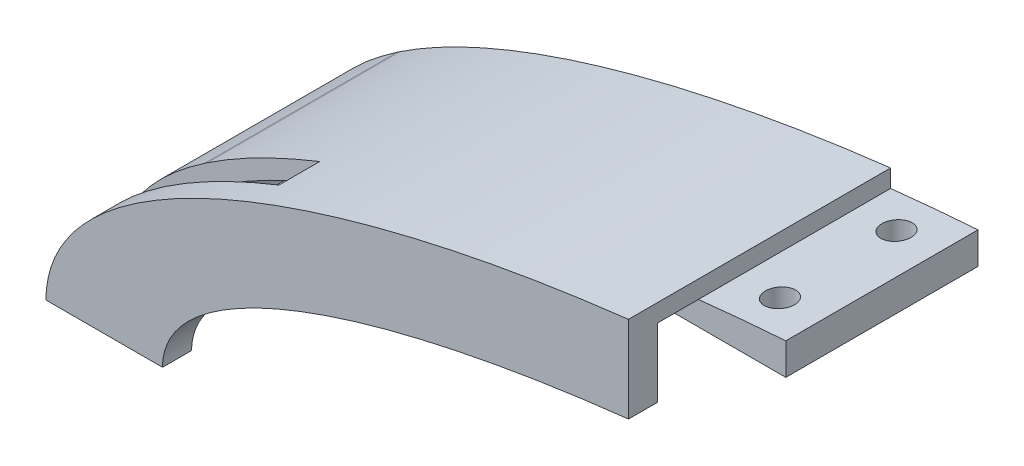
ISO-10303-21;
HEADER;
FILE_DESCRIPTION(('STEP AP214'),'2;1');
FILE_NAME('part.step','',(''),(''),'','','');
FILE_SCHEMA(('AUTOMOTIVE_DESIGN { 1 0 10303 214 1 1 1 1 }'));
ENDSEC;
DATA;
#1=APPLICATION_CONTEXT('core data for automotive mechanical design processes');
#2=APPLICATION_PROTOCOL_DEFINITION('international standard','automotive_design',2000,#1);
#3=PRODUCT_CONTEXT('',#1,'mechanical');
#4=PRODUCT('Part','Part','',(#3));
#5=PRODUCT_RELATED_PRODUCT_CATEGORY('part','',(#4));
#6=PRODUCT_DEFINITION_FORMATION('','',#4);
#7=PRODUCT_DEFINITION_CONTEXT('part definition',#1,'design');
#8=PRODUCT_DEFINITION('design','',#6,#7);
#9=PRODUCT_DEFINITION_SHAPE('','',#8);
#10=(LENGTH_UNIT() NAMED_UNIT(*) SI_UNIT(.MILLI.,.METRE.));
#11=(NAMED_UNIT(*) PLANE_ANGLE_UNIT() SI_UNIT($,.RADIAN.));
#12=(NAMED_UNIT(*) SI_UNIT($,.STERADIAN.) SOLID_ANGLE_UNIT());
#13=UNCERTAINTY_MEASURE_WITH_UNIT(LENGTH_MEASURE(1.E-05),#10,'distance_accuracy_value','');
#14=(GEOMETRIC_REPRESENTATION_CONTEXT(3) GLOBAL_UNCERTAINTY_ASSIGNED_CONTEXT((#13)) GLOBAL_UNIT_ASSIGNED_CONTEXT((#10,
#11,#12)) REPRESENTATION_CONTEXT('',''));
#15=CARTESIAN_POINT('',(0.,0.,0.));
#16=DIRECTION('',(0.,0.,1.));
#17=DIRECTION('',(1.,0.,0.));
#18=AXIS2_PLACEMENT_3D('',#15,#16,#17);
#19=CARTESIAN_POINT('',(-50.,0.,0.));
#20=DIRECTION('',(-1.,0.,0.));
#21=DIRECTION('',(0.,-1.,0.));
#22=AXIS2_PLACEMENT_3D('',#19,#20,#21);
#23=PLANE('',#22);
#24=DIRECTION('',(0.,0.,1.));
#25=VECTOR('',#24,1.);
#26=CARTESIAN_POINT('',(-50.,44.0928528927283,-40.));
#27=LINE('',#26,#25);
#28=CARTESIAN_POINT('',(-50.,44.0928528927283,0.));
#29=VERTEX_POINT('',#28);
#30=CARTESIAN_POINT('',(-50.,44.0928528927283,-7.00000000000003));
#31=VERTEX_POINT('',#30);
#32=EDGE_CURVE('E47',#29,#31,#27,.F.);
#33=ORIENTED_EDGE('',*,*,#32,.T.);
#34=DIRECTION('',(0.,0.,1.));
#35=VECTOR('',#34,1.);
#36=CARTESIAN_POINT('',(-50.,44.0928528927283,-40.));
#37=LINE('',#36,#35);
#38=CARTESIAN_POINT('',(-50.0000000000001,44.0928528927283,-40.));
#39=VERTEX_POINT('',#38);
#40=EDGE_CURVE('E210',#39,#31,#37,.T.);
#41=ORIENTED_EDGE('',*,*,#40,.F.);
#42=DIRECTION('',(0.,-1.,0.));
#43=VECTOR('',#42,1.);
#44=CARTESIAN_POINT('',(-50.,0.,-40.));
#45=LINE('',#44,#43);
#46=CARTESIAN_POINT('',(-50.,47.1404520791032,-40.));
#47=VERTEX_POINT('',#46);
#48=EDGE_CURVE('E336',#47,#39,#45,.T.);
#49=ORIENTED_EDGE('',*,*,#48,.F.);
#50=DIRECTION('',(0.,0.,-1.));
#51=VECTOR('',#50,1.);
#52=CARTESIAN_POINT('',(-50.,47.1404520791032,5.));
#53=LINE('',#52,#51);
#54=CARTESIAN_POINT('',(-50.,47.1404520791032,5.));
#55=VERTEX_POINT('',#54);
#56=EDGE_CURVE('E458',#55,#47,#53,.T.);
#57=ORIENTED_EDGE('',*,*,#56,.F.);
#58=DIRECTION('',(0.,-1.,0.));
#59=VECTOR('',#58,1.);
#60=CARTESIAN_POINT('',(-50.,0.,5.));
#61=LINE('',#60,#59);
#62=CARTESIAN_POINT('',(-50.,32.3076923076923,5.));
#63=VERTEX_POINT('',#62);
#64=EDGE_CURVE('E11',#55,#63,#61,.T.);
#65=ORIENTED_EDGE('',*,*,#64,.T.);
#66=DIRECTION('',(0.,0.,1.));
#67=VECTOR('',#66,1.);
#68=CARTESIAN_POINT('',(-50.,32.3076923076923,2.5));
#69=LINE('',#68,#67);
#70=CARTESIAN_POINT('',(-50.,32.3076923076923,0.));
#71=VERTEX_POINT('',#70);
#72=EDGE_CURVE('E338',#71,#63,#69,.T.);
#73=ORIENTED_EDGE('',*,*,#72,.F.);
#74=DIRECTION('',(0.,-1.,0.));
#75=VECTOR('',#74,1.);
#76=CARTESIAN_POINT('',(-50.,0.,0.));
#77=LINE('',#76,#75);
#78=EDGE_CURVE('E42',#29,#71,#77,.T.);
#79=ORIENTED_EDGE('',*,*,#78,.F.);
#80=EDGE_LOOP('',(#33,#41,#49,#57,#65,#73,#79));
#81=FACE_BOUND('',#80,.T.);
#82=ADVANCED_FACE('F39',(#81),#23,.F.);
#83=CARTESIAN_POINT('',(0.,0.,5.));
#84=DIRECTION('',(0.,0.,1.));
#85=DIRECTION('',(1.,0.,0.));
#86=AXIS2_PLACEMENT_3D('',#83,#84,#85);
#87=ELLIPSE('',#86,150.,50.);
#88=DIRECTION('',(0.,0.,-1.));
#89=VECTOR('',#88,1.);
#90=SURFACE_OF_LINEAR_EXTRUSION('',#87,#89);
#91=CARTESIAN_POINT('',(-134.274226106668,22.2870969233957,5.));
#92=VERTEX_POINT('',#91);
#93=EDGE_CURVE('E340',#55,#92,#87,.T.);
#94=ORIENTED_EDGE('',*,*,#93,.F.);
#95=ORIENTED_EDGE('',*,*,#56,.T.);
#96=CARTESIAN_POINT('',(0.,0.,-40.));
#97=DIRECTION('',(0.,0.,1.));
#98=DIRECTION('',(1.,0.,0.));
#99=AXIS2_PLACEMENT_3D('',#96,#97,#98);
#100=ELLIPSE('',#99,150.,50.);
#101=CARTESIAN_POINT('',(-134.274226106668,22.2870969233957,-40.));
#102=VERTEX_POINT('',#101);
#103=EDGE_CURVE('E299',#47,#102,#100,.T.);
#104=ORIENTED_EDGE('',*,*,#103,.T.);
#105=DIRECTION('',(0.,0.,1.));
#106=VECTOR('',#105,1.);
#107=CARTESIAN_POINT('',(-134.274226106668,22.2870969233957,-40.));
#108=LINE('',#107,#106);
#109=CARTESIAN_POINT('',(-134.274226106668,22.2870969233956,-7.00000000000002));
#110=VERTEX_POINT('',#109);
#111=EDGE_CURVE('E318',#102,#110,#108,.T.);
#112=ORIENTED_EDGE('',*,*,#111,.T.);
#113=CARTESIAN_POINT('',(0.,0.,-7.));
#114=DIRECTION('',(0.,0.,1.));
#115=DIRECTION('',(1.,0.,0.));
#116=AXIS2_PLACEMENT_3D('',#113,#114,#115);
#117=ELLIPSE('',#116,150.,50.);
#118=CARTESIAN_POINT('',(-115.,32.1022671404304,-7.));
#119=VERTEX_POINT('',#118);
#120=EDGE_CURVE('E433',#110,#119,#117,.F.);
#121=ORIENTED_EDGE('',*,*,#120,.T.);
#122=DIRECTION('',(0.,0.,-1.));
#123=VECTOR('',#122,1.);
#124=CARTESIAN_POINT('',(-115.,32.1022671404304,5.));
#125=LINE('',#124,#123);
#126=CARTESIAN_POINT('',(-115.,32.1022671404304,0.));
#127=VERTEX_POINT('',#126);
#128=EDGE_CURVE('E429',#127,#119,#125,.T.);
#129=ORIENTED_EDGE('',*,*,#128,.F.);
#130=CARTESIAN_POINT('',(0.,0.,0.));
#131=DIRECTION('',(0.,0.,1.));
#132=DIRECTION('',(1.,0.,0.));
#133=AXIS2_PLACEMENT_3D('',#130,#131,#132);
#134=ELLIPSE('',#133,150.,50.);
#135=CARTESIAN_POINT('',(-134.274226106668,22.2870969233956,0.));
#136=VERTEX_POINT('',#135);
#137=EDGE_CURVE('E424',#136,#127,#134,.F.);
#138=ORIENTED_EDGE('',*,*,#137,.F.);
#139=CARTESIAN_POINT('',(0.,0.,0.));
#140=DIRECTION('',(0.,0.,1.));
#141=DIRECTION('',(1.,0.,0.));
#142=AXIS2_PLACEMENT_3D('',#139,#140,#141);
#143=ELLIPSE('',#142,150.,50.);
#144=CARTESIAN_POINT('',(-134.779349014432,21.9457084623899,0.));
#145=VERTEX_POINT('',#144);
#146=EDGE_CURVE('E420',#136,#145,#143,.T.);
#147=ORIENTED_EDGE('',*,*,#146,.T.);
#148=CARTESIAN_POINT('',(0.,0.,0.));
#149=DIRECTION('',(0.,0.,1.));
#150=DIRECTION('',(1.,0.,0.));
#151=AXIS2_PLACEMENT_3D('',#148,#149,#150);
#152=ELLIPSE('',#151,150.,50.);
#153=CARTESIAN_POINT('',(-150.,0.,0.));
#154=VERTEX_POINT('',#153);
#155=EDGE_CURVE('E359',#145,#154,#152,.T.);
#156=ORIENTED_EDGE('',*,*,#155,.T.);
#157=DIRECTION('',(0.,0.,-1.));
#158=VECTOR('',#157,1.);
#159=CARTESIAN_POINT('',(-150.,0.,5.));
#160=LINE('',#159,#158);
#161=CARTESIAN_POINT('',(-150.,0.,5.));
#162=VERTEX_POINT('',#161);
#163=EDGE_CURVE('E331',#154,#162,#160,.F.);
#164=ORIENTED_EDGE('',*,*,#163,.T.);
#165=CARTESIAN_POINT('',(-134.779349014434,21.9457084623884,5.));
#166=VERTEX_POINT('',#165);
#167=EDGE_CURVE('E344',#166,#162,#87,.T.);
#168=ORIENTED_EDGE('',*,*,#167,.F.);
#169=CARTESIAN_POINT('',(0.,0.,5.));
#170=DIRECTION('',(0.,0.,-1.));
#171=DIRECTION('',(1.,0.,0.));
#172=AXIS2_PLACEMENT_3D('',#169,#170,#171);
#173=ELLIPSE('',#172,150.,50.);
#174=EDGE_CURVE('E368',#92,#166,#173,.F.);
#175=ORIENTED_EDGE('',*,*,#174,.F.);
#176=EDGE_LOOP('',(#94,#95,#104,#112,#121,#129,#138,#147,#156,#164,#168,#175));
#177=FACE_BOUND('',#176,.T.);
#178=ADVANCED_FACE('F250',(#177),#90,.F.);
#179=DIRECTION('',(0.,0.,1.));
#180=VECTOR('',#179,1.);
#181=CARTESIAN_POINT('',(-145.300907362266,12.4170416932275,-40.));
#182=LINE('',#181,#180);
#183=CARTESIAN_POINT('',(-145.300907362266,12.4170416932275,-40.));
#184=VERTEX_POINT('',#183);
#185=CARTESIAN_POINT('',(-145.300907362266,12.4170416932275,-7.00000000000002));
#186=VERTEX_POINT('',#185);
#187=EDGE_CURVE('E306',#184,#186,#182,.T.);
#188=ORIENTED_EDGE('',*,*,#187,.T.);
#189=CARTESIAN_POINT('',(-134.779349014432,21.9457084623899,-7.));
#190=VERTEX_POINT('',#189);
#191=EDGE_CURVE('E405',#186,#190,#117,.F.);
#192=ORIENTED_EDGE('',*,*,#191,.T.);
#193=DIRECTION('',(0.,0.,1.));
#194=VECTOR('',#193,1.);
#195=CARTESIAN_POINT('',(-134.779349014432,21.9457084623899,-40.));
#196=LINE('',#195,#194);
#197=CARTESIAN_POINT('',(-134.779349014432,21.9457084623899,-40.));
#198=VERTEX_POINT('',#197);
#199=EDGE_CURVE('E315',#198,#190,#196,.T.);
#200=ORIENTED_EDGE('',*,*,#199,.F.);
#201=EDGE_CURVE('E292',#198,#184,#100,.T.);
#202=ORIENTED_EDGE('',*,*,#201,.T.);
#203=EDGE_LOOP('',(#188,#192,#200,#202));
#204=FACE_BOUND('',#203,.T.);
#205=ADVANCED_FACE('F257',(#204),#90,.F.);
#206=CARTESIAN_POINT('',(-172.714644282662,0.,-343.285055293836));
#207=DIRECTION('',(0.,1.,0.));
#208=DIRECTION('',(0.,0.,1.));
#209=AXIS2_PLACEMENT_3D('',#206,#207,#208);
#210=PLANE('',#209);
#211=ORIENTED_EDGE('',*,*,#163,.F.);
#212=DIRECTION('',(1.,0.,0.));
#213=VECTOR('',#212,1.);
#214=CARTESIAN_POINT('',(-172.714644282662,0.,0.));
#215=LINE('',#214,#213);
#216=CARTESIAN_POINT('',(-130.,0.,0.));
#217=VERTEX_POINT('',#216);
#218=EDGE_CURVE('E328',#154,#217,#215,.T.);
#219=ORIENTED_EDGE('',*,*,#218,.T.);
#220=DIRECTION('',(0.,0.,1.));
#221=VECTOR('',#220,1.);
#222=CARTESIAN_POINT('',(-130.,0.,2.5));
#223=LINE('',#222,#221);
#224=CARTESIAN_POINT('',(-130.,0.,5.));
#225=VERTEX_POINT('',#224);
#226=EDGE_CURVE('E343',#225,#217,#223,.F.);
#227=ORIENTED_EDGE('',*,*,#226,.F.);
#228=DIRECTION('',(-1.,0.,0.));
#229=VECTOR('',#228,1.);
#230=CARTESIAN_POINT('',(-172.714644282662,0.,5.));
#231=LINE('',#230,#229);
#232=EDGE_CURVE('E325',#225,#162,#231,.T.);
#233=ORIENTED_EDGE('',*,*,#232,.T.);
#234=EDGE_LOOP('',(#211,#219,#227,#233));
#235=FACE_BOUND('',#234,.T.);
#236=ADVANCED_FACE('F481',(#235),#210,.F.);
#237=CARTESIAN_POINT('',(-147.297229877736,0.,-40.));
#238=CARTESIAN_POINT('',(-146.55190637035,8.1210873517637,-40.));
#239=CARTESIAN_POINT('',(-134.103124610867,20.5937570390856,-40.));
#240=CARTESIAN_POINT('',(-110.28433455085,31.4682746566878,-40.));
#241=CARTESIAN_POINT('',(-65.5548375328861,44.1559680318761,-40.));
#242=CARTESIAN_POINT('',(-27.8686299807415,46.563681344994,-40.));
#243=CARTESIAN_POINT('',(0.,46.6002426808814,-40.));
#244=B_SPLINE_CURVE_WITH_KNOTS('',3,(#237,#238,#239,#240,#241,#242,#243),.UNSPECIFIED.,.F.,.F.,
(4,1,1,1,4),(0.,0.141743179969019,0.308701525327165,0.483121699978807,1.),.UNSPECIFIED.);
#245=DIRECTION('',(0.,0.,1.));
#246=VECTOR('',#245,1.);
#247=SURFACE_OF_LINEAR_EXTRUSION('',#244,#246);
#248=DIRECTION('',(0.,0.,1.));
#249=VECTOR('',#248,1.);
#250=CARTESIAN_POINT('',(-65.,42.0902168247646,-40.));
#251=LINE('',#250,#249);
#252=CARTESIAN_POINT('',(-65.,42.0902168247646,-40.));
#253=VERTEX_POINT('',#252);
#254=CARTESIAN_POINT('',(-65.,42.0902168247645,-7.00000000000002));
#255=VERTEX_POINT('',#254);
#256=EDGE_CURVE('E55',#253,#255,#251,.T.);
#257=ORIENTED_EDGE('',*,*,#256,.T.);
#258=CARTESIAN_POINT('',(-147.297229877736,0.,-7.00000000000002));
#259=CARTESIAN_POINT('',(-146.55190637035,8.1210873517637,-7.00000000000002));
#260=CARTESIAN_POINT('',(-134.103124610867,20.5937570390856,-7.00000000000002));
#261=CARTESIAN_POINT('',(-110.28433455085,31.4682746566878,-7.00000000000002));
#262=CARTESIAN_POINT('',(-65.5548375328861,44.1559680318761,-7.00000000000002));
#263=CARTESIAN_POINT('',(-27.8686299807415,46.563681344994,-7.00000000000002));
#264=CARTESIAN_POINT('',(0.,46.6002426808814,-7.00000000000002));
#265=B_SPLINE_CURVE_WITH_KNOTS('',3,(#258,#259,#260,#261,#262,#263,#264),.UNSPECIFIED.,.F.,.F.,
(4,1,1,1,4),(0.,0.141743179969019,0.308701525327165,0.483121699978807,1.),.UNSPECIFIED.);
#266=EDGE_CURVE('E60',#255,#31,#265,.T.);
#267=ORIENTED_EDGE('',*,*,#266,.T.);
#268=ORIENTED_EDGE('',*,*,#32,.F.);
#269=CARTESIAN_POINT('',(-147.297229877736,0.,0.));
#270=CARTESIAN_POINT('',(-146.55190637035,8.1210873517637,0.));
#271=CARTESIAN_POINT('',(-134.103124610867,20.5937570390856,0.));
#272=CARTESIAN_POINT('',(-110.28433455085,31.4682746566878,0.));
#273=CARTESIAN_POINT('',(-65.5548375328861,44.1559680318761,0.));
#274=CARTESIAN_POINT('',(-27.8686299807415,46.563681344994,0.));
#275=CARTESIAN_POINT('',(0.,46.6002426808814,0.));
#276=B_SPLINE_CURVE_WITH_KNOTS('',3,(#269,#270,#271,#272,#273,#274,#275),.UNSPECIFIED.,.F.,.F.,
(4,1,1,1,4),(0.,0.141743179969019,0.308701525327165,0.483121699978807,1.),.UNSPECIFIED.);
#277=CARTESIAN_POINT('',(-115.,28.8998222705045,0.));
#278=VERTEX_POINT('',#277);
#279=EDGE_CURVE('E313',#278,#29,#276,.T.);
#280=ORIENTED_EDGE('',*,*,#279,.F.);
#281=DIRECTION('',(0.,0.,1.));
#282=VECTOR('',#281,1.);
#283=CARTESIAN_POINT('',(-115.,28.8998222705045,-40.));
#284=LINE('',#283,#282);
#285=CARTESIAN_POINT('',(-115.,28.8998222694203,-7.));
#286=VERTEX_POINT('',#285);
#287=EDGE_CURVE('E339',#278,#286,#284,.F.);
#288=ORIENTED_EDGE('',*,*,#287,.T.);
#289=CARTESIAN_POINT('',(-147.297229877736,0.,-7.00000000000002));
#290=CARTESIAN_POINT('',(-146.55190637035,8.1210873517637,-7.00000000000002));
#291=CARTESIAN_POINT('',(-134.103124610867,20.5937570390856,-7.00000000000002));
#292=CARTESIAN_POINT('',(-110.28433455085,31.4682746566878,-7.00000000000002));
#293=CARTESIAN_POINT('',(-65.5548375328861,44.1559680318761,-7.00000000000002));
#294=CARTESIAN_POINT('',(-27.8686299807415,46.563681344994,-7.00000000000002));
#295=CARTESIAN_POINT('',(0.,46.6002426808814,-7.00000000000002));
#296=B_SPLINE_CURVE_WITH_KNOTS('',3,(#289,#290,#291,#292,#293,#294,#295),.UNSPECIFIED.,.F.,.F.,
(4,1,1,1,4),(0.,0.141743179969019,0.308701525327165,0.483121699978807,1.),.UNSPECIFIED.);
#297=CARTESIAN_POINT('',(-147.297229877736,0.,-7.00000000000003));
#298=VERTEX_POINT('',#297);
#299=EDGE_CURVE('E393',#298,#286,#296,.T.);
#300=ORIENTED_EDGE('',*,*,#299,.F.);
#301=DIRECTION('',(0.,0.,1.));
#302=VECTOR('',#301,1.);
#303=CARTESIAN_POINT('',(-147.297229877736,0.,-40.));
#304=LINE('',#303,#302);
#305=CARTESIAN_POINT('',(-147.297229877736,0.,-40.));
#306=VERTEX_POINT('',#305);
#307=EDGE_CURVE('E291',#306,#298,#304,.T.);
#308=ORIENTED_EDGE('',*,*,#307,.F.);
#309=EDGE_CURVE('E294',#306,#253,#244,.T.);
#310=ORIENTED_EDGE('',*,*,#309,.T.);
#311=EDGE_LOOP('',(#257,#267,#268,#280,#288,#300,#308,#310));
#312=FACE_BOUND('',#311,.T.);
#313=ADVANCED_FACE('F283',(#312),#247,.T.);
#314=CARTESIAN_POINT('',(0.,0.,0.));
#315=DIRECTION('',(0.,0.,1.));
#316=DIRECTION('',(1.,0.,0.));
#317=AXIS2_PLACEMENT_3D('',#314,#315,#316);
#318=PLANE('',#317);
#319=ORIENTED_EDGE('',*,*,#279,.T.);
#320=ORIENTED_EDGE('',*,*,#78,.T.);
#321=CARTESIAN_POINT('',(0.,0.,0.));
#322=DIRECTION('',(0.,0.,1.));
#323=DIRECTION('',(1.,0.,0.));
#324=AXIS2_PLACEMENT_3D('',#321,#322,#323);
#325=ELLIPSE('',#324,130.,35.);
#326=EDGE_CURVE('E349',#217,#71,#325,.F.);
#327=ORIENTED_EDGE('',*,*,#326,.F.);
#328=ORIENTED_EDGE('',*,*,#218,.F.);
#329=ORIENTED_EDGE('',*,*,#155,.F.);
#330=ORIENTED_EDGE('',*,*,#146,.F.);
#331=ORIENTED_EDGE('',*,*,#137,.T.);
#332=DIRECTION('',(0.,-1.,0.));
#333=VECTOR('',#332,1.);
#334=CARTESIAN_POINT('',(-115.,50.0005,0.));
#335=LINE('',#334,#333);
#336=EDGE_CURVE('E406',#127,#278,#335,.T.);
#337=ORIENTED_EDGE('',*,*,#336,.T.);
#338=EDGE_LOOP('',(#319,#320,#327,#328,#329,#330,#331,#337));
#339=FACE_BOUND('',#338,.T.);
#340=ADVANCED_FACE('F422',(#339),#318,.F.);
#341=CARTESIAN_POINT('',(0.,0.,-269.258240356725));
#342=DIRECTION('',(0.,0.,1.));
#343=DIRECTION('',(1.,0.,0.));
#344=AXIS2_PLACEMENT_3D('',#341,#342,#343);
#345=ELLIPSE('',#344,130.,35.);
#346=DIRECTION('',(0.,0.,1.));
#347=VECTOR('',#346,1.);
#348=SURFACE_OF_LINEAR_EXTRUSION('',#345,#347);
#349=ORIENTED_EDGE('',*,*,#326,.T.);
#350=ORIENTED_EDGE('',*,*,#72,.T.);
#351=CARTESIAN_POINT('',(0.,0.,5.));
#352=DIRECTION('',(0.,0.,1.));
#353=DIRECTION('',(1.,0.,0.));
#354=AXIS2_PLACEMENT_3D('',#351,#352,#353);
#355=ELLIPSE('',#354,130.,35.);
#356=EDGE_CURVE('E381',#63,#225,#355,.T.);
#357=ORIENTED_EDGE('',*,*,#356,.T.);
#358=ORIENTED_EDGE('',*,*,#226,.T.);
#359=EDGE_LOOP('',(#349,#350,#357,#358));
#360=FACE_BOUND('',#359,.T.);
#361=ADVANCED_FACE('F471',(#360),#348,.F.);
#362=CARTESIAN_POINT('',(0.,0.,5.));
#363=DIRECTION('',(0.,0.,1.));
#364=DIRECTION('',(1.,0.,0.));
#365=AXIS2_PLACEMENT_3D('',#362,#363,#364);
#366=PLANE('',#365);
#367=ORIENTED_EDGE('',*,*,#64,.F.);
#368=ORIENTED_EDGE('',*,*,#93,.T.);
#369=ORIENTED_EDGE('',*,*,#174,.T.);
#370=ORIENTED_EDGE('',*,*,#167,.T.);
#371=ORIENTED_EDGE('',*,*,#232,.F.);
#372=ORIENTED_EDGE('',*,*,#356,.F.);
#373=EDGE_LOOP('',(#367,#368,#369,#370,#371,#372));
#374=FACE_BOUND('',#373,.T.);
#375=ADVANCED_FACE('F462',(#374),#366,.T.);
#376=ORIENTED_EDGE('',*,*,#307,.T.);
#377=DIRECTION('',(1.,0.,0.));
#378=VECTOR('',#377,1.);
#379=CARTESIAN_POINT('',(-150.,0.,-7.));
#380=LINE('',#379,#378);
#381=CARTESIAN_POINT('',(-150.,0.,-7.));
#382=VERTEX_POINT('',#381);
#383=EDGE_CURVE('E411',#382,#298,#380,.T.);
#384=ORIENTED_EDGE('',*,*,#383,.F.);
#385=DIRECTION('',(0.,0.,1.));
#386=VECTOR('',#385,1.);
#387=CARTESIAN_POINT('',(-150.,0.,-40.));
#388=LINE('',#387,#386);
#389=CARTESIAN_POINT('',(-150.,0.,-40.));
#390=VERTEX_POINT('',#389);
#391=EDGE_CURVE('E309',#390,#382,#388,.T.);
#392=ORIENTED_EDGE('',*,*,#391,.F.);
#393=DIRECTION('',(1.,0.,0.));
#394=VECTOR('',#393,1.);
#395=CARTESIAN_POINT('',(0.,0.,-40.));
#396=LINE('',#395,#394);
#397=EDGE_CURVE('E430',#390,#306,#396,.T.);
#398=ORIENTED_EDGE('',*,*,#397,.T.);
#399=EDGE_LOOP('',(#376,#384,#392,#398));
#400=FACE_BOUND('',#399,.T.);
#401=ADVANCED_FACE('F281',(#400),#210,.F.);
#402=CARTESIAN_POINT('',(-150.,0.,-40.));
#403=CARTESIAN_POINT('',(-149.366974801961,10.0364415380543,-40.));
#404=CARTESIAN_POINT('',(-134.490815562498,24.4032961206006,-40.));
#405=CARTESIAN_POINT('',(-108.511776452667,35.2074679810045,-40.));
#406=CARTESIAN_POINT('',(-63.6543444537667,47.1037533474138,-40.));
#407=CARTESIAN_POINT('',(-27.5396604460598,49.9400050182537,-40.));
#408=CARTESIAN_POINT('',(-5.28874849839181E-13,50.,-40.));
#409=B_SPLINE_CURVE_WITH_KNOTS('',3,(#402,#403,#404,#405,#406,#407,#408),.UNSPECIFIED.,.F.,.F.,
(4,1,1,1,4),(0.,0.164934741661339,0.354369831819262,0.50328897730762,1.),.UNSPECIFIED.);
#410=DIRECTION('',(0.,0.,1.));
#411=VECTOR('',#410,1.);
#412=SURFACE_OF_LINEAR_EXTRUSION('',#409,#411);
#413=ORIENTED_EDGE('',*,*,#199,.T.);
#414=CARTESIAN_POINT('',(-150.,0.,-7.00000000000002));
#415=CARTESIAN_POINT('',(-149.366974801961,10.0364415380543,-7.00000000000002));
#416=CARTESIAN_POINT('',(-134.490815562498,24.4032961206006,-7.00000000000002));
#417=CARTESIAN_POINT('',(-108.511776452667,35.2074679810045,-7.00000000000002));
#418=CARTESIAN_POINT('',(-63.6543444537667,47.1037533474138,-7.00000000000002));
#419=CARTESIAN_POINT('',(-27.5396604460598,49.9400050182537,-7.00000000000002));
#420=CARTESIAN_POINT('',(-5.28874849839181E-13,50.,-7.00000000000002));
#421=B_SPLINE_CURVE_WITH_KNOTS('',3,(#414,#415,#416,#417,#418,#419,#420),.UNSPECIFIED.,.F.,.F.,
(4,1,1,1,4),(0.,0.164934741661339,0.354369831819262,0.50328897730762,1.),.UNSPECIFIED.);
#422=EDGE_CURVE('E438',#190,#110,#421,.T.);
#423=ORIENTED_EDGE('',*,*,#422,.T.);
#424=ORIENTED_EDGE('',*,*,#111,.F.);
#425=EDGE_CURVE('E293',#198,#102,#409,.T.);
#426=ORIENTED_EDGE('',*,*,#425,.F.);
#427=EDGE_LOOP('',(#413,#423,#424,#426));
#428=FACE_BOUND('',#427,.T.);
#429=ADVANCED_FACE('F277',(#428),#412,.F.);
#430=ORIENTED_EDGE('',*,*,#391,.T.);
#431=CARTESIAN_POINT('',(-150.,0.,-7.00000000000002));
#432=CARTESIAN_POINT('',(-149.366974801961,10.0364415380543,-7.00000000000002));
#433=CARTESIAN_POINT('',(-134.490815562498,24.4032961206006,-7.00000000000002));
#434=CARTESIAN_POINT('',(-108.511776452667,35.2074679810045,-7.00000000000002));
#435=CARTESIAN_POINT('',(-63.6543444537667,47.1037533474138,-7.00000000000002));
#436=CARTESIAN_POINT('',(-27.5396604460598,49.9400050182537,-7.00000000000002));
#437=CARTESIAN_POINT('',(-5.28874849839181E-13,50.,-7.00000000000002));
#438=B_SPLINE_CURVE_WITH_KNOTS('',3,(#431,#432,#433,#434,#435,#436,#437),.UNSPECIFIED.,.F.,.F.,
(4,1,1,1,4),(0.,0.164934741661339,0.354369831819262,0.50328897730762,1.),.UNSPECIFIED.);
#439=EDGE_CURVE('E402',#382,#186,#438,.T.);
#440=ORIENTED_EDGE('',*,*,#439,.T.);
#441=ORIENTED_EDGE('',*,*,#187,.F.);
#442=EDGE_CURVE('E286',#390,#184,#409,.T.);
#443=ORIENTED_EDGE('',*,*,#442,.F.);
#444=EDGE_LOOP('',(#430,#440,#441,#443));
#445=FACE_BOUND('',#444,.T.);
#446=ADVANCED_FACE('F275',(#445),#412,.F.);
#447=CARTESIAN_POINT('',(0.,0.,-40.));
#448=DIRECTION('',(0.,0.,1.));
#449=DIRECTION('',(1.,0.,0.));
#450=AXIS2_PLACEMENT_3D('',#447,#448,#449);
#451=PLANE('',#450);
#452=ORIENTED_EDGE('',*,*,#103,.F.);
#453=ORIENTED_EDGE('',*,*,#48,.T.);
#454=CARTESIAN_POINT('',(-147.297229877736,0.,-40.));
#455=CARTESIAN_POINT('',(-146.55190637035,8.1210873517637,-40.));
#456=CARTESIAN_POINT('',(-134.103124610867,20.5937570390856,-40.));
#457=CARTESIAN_POINT('',(-110.28433455085,31.4682746566878,-40.));
#458=CARTESIAN_POINT('',(-65.5548375328861,44.1559680318761,-40.));
#459=CARTESIAN_POINT('',(-27.8686299807415,46.563681344994,-40.));
#460=CARTESIAN_POINT('',(0.,46.6002426808814,-40.));
#461=B_SPLINE_CURVE_WITH_KNOTS('',3,(#454,#455,#456,#457,#458,#459,#460),.UNSPECIFIED.,.F.,.F.,
(4,1,1,1,4),(0.,0.141743179969019,0.308701525327165,0.483121699978807,1.),.UNSPECIFIED.);
#462=CARTESIAN_POINT('',(-35.0000000000001,45.4411229775927,-40.));
#463=VERTEX_POINT('',#462);
#464=EDGE_CURVE('E212',#463,#39,#461,.F.);
#465=ORIENTED_EDGE('',*,*,#464,.F.);
#466=DIRECTION('',(0.,-1.,0.));
#467=VECTOR('',#466,1.);
#468=CARTESIAN_POINT('',(-35.,50.0015,-40.));
#469=LINE('',#468,#467);
#470=CARTESIAN_POINT('',(-35.,40.,-40.));
#471=VERTEX_POINT('',#470);
#472=EDGE_CURVE('E202',#463,#471,#469,.T.);
#473=ORIENTED_EDGE('',*,*,#472,.T.);
#474=DIRECTION('',(1.,0.,0.));
#475=VECTOR('',#474,1.);
#476=CARTESIAN_POINT('',(-35.,40.,-40.));
#477=LINE('',#476,#475);
#478=CARTESIAN_POINT('',(-65.,40.,-40.));
#479=VERTEX_POINT('',#478);
#480=EDGE_CURVE('E180',#479,#471,#477,.T.);
#481=ORIENTED_EDGE('',*,*,#480,.F.);
#482=DIRECTION('',(0.,-1.,0.));
#483=VECTOR('',#482,1.);
#484=CARTESIAN_POINT('',(-65.,50.0015,-40.));
#485=LINE('',#484,#483);
#486=EDGE_CURVE('E204',#253,#479,#485,.T.);
#487=ORIENTED_EDGE('',*,*,#486,.F.);
#488=ORIENTED_EDGE('',*,*,#309,.F.);
#489=ORIENTED_EDGE('',*,*,#397,.F.);
#490=ORIENTED_EDGE('',*,*,#442,.T.);
#491=ORIENTED_EDGE('',*,*,#201,.F.);
#492=ORIENTED_EDGE('',*,*,#425,.T.);
#493=EDGE_LOOP('',(#452,#453,#465,#473,#481,#487,#488,#489,#490,#491,#492));
#494=FACE_BOUND('',#493,.T.);
#495=ADVANCED_FACE('F268',(#494),#451,.F.);
#496=CARTESIAN_POINT('',(-115.,50.0005,0.));
#497=DIRECTION('',(-1.,0.,0.));
#498=DIRECTION('',(0.,0.,1.));
#499=AXIS2_PLACEMENT_3D('',#496,#497,#498);
#500=PLANE('',#499);
#501=ORIENTED_EDGE('',*,*,#128,.T.);
#502=DIRECTION('',(0.,-1.,0.));
#503=VECTOR('',#502,1.);
#504=CARTESIAN_POINT('',(-115.,50.0005,-7.));
#505=LINE('',#504,#503);
#506=EDGE_CURVE('E416',#119,#286,#505,.T.);
#507=ORIENTED_EDGE('',*,*,#506,.T.);
#508=ORIENTED_EDGE('',*,*,#287,.F.);
#509=ORIENTED_EDGE('',*,*,#336,.F.);
#510=EDGE_LOOP('',(#501,#507,#508,#509));
#511=FACE_BOUND('',#510,.T.);
#512=ADVANCED_FACE('F260',(#511),#500,.T.);
#513=CARTESIAN_POINT('',(-150.,50.0005,-7.));
#514=DIRECTION('',(0.,0.,-1.));
#515=DIRECTION('',(-1.,0.,0.));
#516=AXIS2_PLACEMENT_3D('',#513,#514,#515);
#517=PLANE('',#516);
#518=ORIENTED_EDGE('',*,*,#422,.F.);
#519=ORIENTED_EDGE('',*,*,#191,.F.);
#520=ORIENTED_EDGE('',*,*,#439,.F.);
#521=ORIENTED_EDGE('',*,*,#383,.T.);
#522=ORIENTED_EDGE('',*,*,#299,.T.);
#523=ORIENTED_EDGE('',*,*,#506,.F.);
#524=ORIENTED_EDGE('',*,*,#120,.F.);
#525=EDGE_LOOP('',(#518,#519,#520,#521,#522,#523,#524));
#526=FACE_BOUND('',#525,.T.);
#527=ADVANCED_FACE('F252',(#526),#517,.F.);
#528=CARTESIAN_POINT('',(-147.297229877736,0.,-40.));
#529=CARTESIAN_POINT('',(-146.55190637035,8.1210873517637,-40.));
#530=CARTESIAN_POINT('',(-134.103124610867,20.5937570390856,-40.));
#531=CARTESIAN_POINT('',(-110.28433455085,31.4682746566878,-40.));
#532=CARTESIAN_POINT('',(-65.5548375328861,44.1559680318761,-40.));
#533=CARTESIAN_POINT('',(-27.8686299807415,46.563681344994,-40.));
#534=CARTESIAN_POINT('',(0.,46.6002426808814,-40.));
#535=B_SPLINE_CURVE_WITH_KNOTS('',3,(#528,#529,#530,#531,#532,#533,#534),.UNSPECIFIED.,.F.,.F.,
(4,1,1,1,4),(0.,0.141743179969019,0.308701525327165,0.483121699978807,1.),.UNSPECIFIED.);
#536=DIRECTION('',(0.,0.,1.));
#537=VECTOR('',#536,1.);
#538=SURFACE_OF_LINEAR_EXTRUSION('',#535,#537);
#539=CARTESIAN_POINT('',(-42.5,44.8421955681182,-16.));
#540=CARTESIAN_POINT('',(-42.3592084155711,44.8548107542031,-15.9999938328833));
#541=CARTESIAN_POINT('',(-42.2183081408641,44.8673555728007,-15.9880675746695));
#542=CARTESIAN_POINT('',(-41.9403662018676,44.8919482755418,-15.9406413046343));
#543=CARTESIAN_POINT('',(-41.8033293574307,44.9039955469793,-15.9051130965354));
#544=CARTESIAN_POINT('',(-41.5371741444046,44.927256146879,-15.8114610184666));
#545=CARTESIAN_POINT('',(-41.4080528132947,44.9384697876806,-15.7533456626511));
#546=CARTESIAN_POINT('',(-41.1614156893353,44.9597734126804,-15.6161527799869));
#547=CARTESIAN_POINT('',(-41.0438969394229,44.9698636832677,-15.5370806132703));
#548=CARTESIAN_POINT('',(-40.8240140431649,44.9886533526824,-15.3603568091622));
#549=CARTESIAN_POINT('',(-40.7216217045855,44.9973553414388,-15.2627405306962));
#550=CARTESIAN_POINT('',(-40.534682207297,45.0131800835056,-15.0515828693061));
#551=CARTESIAN_POINT('',(-40.4501354360734,45.0203028025251,-14.9380411406777));
#552=CARTESIAN_POINT('',(-40.3016144935617,45.0327773799757,-14.6986938840975));
#553=CARTESIAN_POINT('',(-40.237567935061,45.0381354713727,-14.572933598456));
#554=CARTESIAN_POINT('',(-40.1314955482161,45.0469918392935,-14.3123852016732));
#555=CARTESIAN_POINT('',(-40.0894692731455,45.0504901535466,-14.1775972737386));
#556=CARTESIAN_POINT('',(-40.0287527327147,45.0555397736988,-13.9032559967247));
#557=CARTESIAN_POINT('',(-40.0099925827539,45.0570969103982,-13.7637182185474));
#558=CARTESIAN_POINT('',(-39.9961211051607,45.0582485428228,-13.4834649159491));
#559=CARTESIAN_POINT('',(-40.001009484644,45.0578430628548,-13.3427494061357));
#560=CARTESIAN_POINT('',(-40.034268932439,45.0550805490208,-13.0643428085923));
#561=CARTESIAN_POINT('',(-40.0626070353608,45.052726254777,-12.9266477535143));
#562=CARTESIAN_POINT('',(-40.1419028897079,45.0461225378793,-12.6579812911401));
#563=CARTESIAN_POINT('',(-40.1928606652941,45.0418731132012,-12.5270098910258));
#564=CARTESIAN_POINT('',(-40.3159667297243,45.031572139904,-12.2754076552474));
#565=CARTESIAN_POINT('',(-40.3881289804437,45.0255194038759,-12.1547837005775));
#566=CARTESIAN_POINT('',(-40.5515569598416,45.011752602134,-11.9273661085288));
#567=CARTESIAN_POINT('',(-40.642822886792,45.0040385191776,-11.820572614711));
#568=CARTESIAN_POINT('',(-40.8421009530918,44.9871097104657,-11.6235534124709));
#569=CARTESIAN_POINT('',(-40.9501544811669,44.9778912729147,-11.5333698892502));
#570=CARTESIAN_POINT('',(-41.1797596031254,44.9581916978254,-11.372413844296));
#571=CARTESIAN_POINT('',(-41.3013114440533,44.9477105371766,-11.3016416779091));
#572=CARTESIAN_POINT('',(-41.5549142525825,44.9257094410033,-11.1812539427755));
#573=CARTESIAN_POINT('',(-41.6870004634146,44.9141859996322,-11.1317132560858));
#574=CARTESIAN_POINT('',(-41.9575555098639,44.8904318131676,-11.0555150382893));
#575=CARTESIAN_POINT('',(-42.0960244673188,44.8782010545713,-11.0288579441894));
#576=CARTESIAN_POINT('',(-42.3758822895955,44.8533224424157,-10.9991084958428));
#577=CARTESIAN_POINT('',(-42.517279012844,44.8406733906051,-10.9960910374316));
#578=CARTESIAN_POINT('',(-42.7985623667223,44.8153508162298,-11.0138945113903));
#579=CARTESIAN_POINT('',(-42.9384489792675,44.8026772933741,-11.0347157289258));
#580=CARTESIAN_POINT('',(-43.2129480305777,44.7776577391293,-11.0996614985194));
#581=CARTESIAN_POINT('',(-43.3475526843223,44.7653121992062,-11.1438191551716));
#582=CARTESIAN_POINT('',(-43.6074450086829,44.7413423552102,-11.2542264751779));
#583=CARTESIAN_POINT('',(-43.7327327006668,44.7297180494831,-11.3204760878635));
#584=CARTESIAN_POINT('',(-43.9702627343928,44.70757005216,-11.4731221592039));
#585=CARTESIAN_POINT('',(-44.0825205674459,44.6970450551096,-11.5594943186719));
#586=CARTESIAN_POINT('',(-44.2909337103242,44.6774220840662,-11.7500035155206));
#587=CARTESIAN_POINT('',(-44.387089292291,44.6683240859558,-11.854140252605));
#588=CARTESIAN_POINT('',(-44.5601986203112,44.6518895350371,-12.0768341065501));
#589=CARTESIAN_POINT('',(-44.6372192827477,44.6445468472679,-12.1953387500584));
#590=CARTESIAN_POINT('',(-44.7702584203589,44.6318327536449,-12.4436995186361));
#591=CARTESIAN_POINT('',(-44.8262774422125,44.6264612964796,-12.5735553481222));
#592=CARTESIAN_POINT('',(-44.9154772431654,44.6178958688465,-12.8403289971547));
#593=CARTESIAN_POINT('',(-44.948755761642,44.6146925800958,-12.9772138402212));
#594=CARTESIAN_POINT('',(-44.9918899189678,44.6105388476363,-13.2546583978108));
#595=CARTESIAN_POINT('',(-45.0017459817086,44.609588363157,-13.395218045782));
#596=CARTESIAN_POINT('',(-44.9977527264994,44.6099732265335,-13.6755833101527));
#597=CARTESIAN_POINT('',(-44.9839727589164,44.6113018871611,-13.8153899292382));
#598=CARTESIAN_POINT('',(-44.9332432580021,44.6161854048802,-14.0906932032397));
#599=CARTESIAN_POINT('',(-44.8962937740755,44.6197402572249,-14.2261898673451));
#600=CARTESIAN_POINT('',(-44.8002983111773,44.6289522638948,-14.4890427072042));
#601=CARTESIAN_POINT('',(-44.7412515531289,44.6346094923427,-14.6163985957558));
#602=CARTESIAN_POINT('',(-44.602770140379,44.6478316511216,-14.8593791661463));
#603=CARTESIAN_POINT('',(-44.5233360256102,44.6553965309308,-14.9750041585496));
#604=CARTESIAN_POINT('',(-44.3461034833003,44.6722036725147,-15.1916088662699));
#605=CARTESIAN_POINT('',(-44.2482536302866,44.6814506289647,-15.2925461320034));
#606=CARTESIAN_POINT('',(-44.0370987309102,44.7013064171401,-15.4765996416487));
#607=CARTESIAN_POINT('',(-43.9237895200573,44.711915615785,-15.5597110680101));
#608=CARTESIAN_POINT('',(-43.6843851607349,44.7342077572393,-15.7061329707003));
#609=CARTESIAN_POINT('',(-43.5582314001937,44.7458955971402,-15.769346751285));
#610=CARTESIAN_POINT('',(-43.297258311842,44.769929896968,-15.8736219114248));
#611=CARTESIAN_POINT('',(-43.1624493128625,44.782275568976,-15.9147091655451));
#612=CARTESIAN_POINT('',(-42.9390013651348,44.8026119308039,-15.9627386452413));
#613=CARTESIAN_POINT('',(-42.8517995951109,44.8105180649284,-15.9766941322184));
#614=CARTESIAN_POINT('',(-42.6764127791128,44.8263571997144,-15.9953267534695));
#615=CARTESIAN_POINT('',(-42.5882277306922,44.8342902004428,-16.0000038646537));
#616=CARTESIAN_POINT('',(-42.5,44.8421955681182,-16.));
#617=B_SPLINE_CURVE_WITH_KNOTS('',3,(#539,#540,#541,#542,#543,#544,#545,#546,#547,#548,#549,
#550,#551,#552,#553,#554,#555,#556,#557,#558,#559,#560,#561,#562,#563,#564,#565,#566,#567,#568,
#569,#570,#571,#572,#573,#574,#575,#576,#577,#578,#579,#580,#581,#582,#583,#584,#585,#586,#587,
#588,#589,#590,#591,#592,#593,#594,#595,#596,#597,#598,#599,#600,#601,#602,#603,#604,#605,#606,
#607,#608,#609,#610,#611,#612,#613,#614,#615,#616),.UNSPECIFIED.,.T.,.F.,(4,2,2,2,2,2,2,2,2,2,2,
2,2,2,2,2,2,2,2,2,2,2,2,2,2,2,2,2,2,2,2,2,2,2,2,2,2,2,4),(0.,0.42374440587188,0.847995954294722,
1.27208773728495,1.69607115464956,2.11925411313931,2.54244625936742,2.96412717368454,
3.38579953301341,3.80620222059851,4.22659970155954,4.64640719389593,5.06621513464631,
5.48630011552224,5.90638945656139,6.3275314349979,6.74868112239746,7.17130419194416,
7.59393533212425,8.01790492618934,8.44187959196193,8.86645732034093,9.29103407494736,
9.71510076094152,10.1391602791272,10.5617152637937,10.9842592484659,11.4049755064445,
11.8256841503877,12.2451605055785,12.6646359663176,13.0841262177666,13.5036053607062,
13.9242737522092,14.3450556892569,14.7678519925313,15.1901528019704,15.4556936326826,
15.7212351242088),.UNSPECIFIED.);
#618=CARTESIAN_POINT('',(-42.5,44.8421955681182,-16.));
#619=VERTEX_POINT('',#618);
#620=EDGE_CURVE('E192',#619,#619,#617,.T.);
#621=ORIENTED_EDGE('',*,*,#620,.T.);
#622=EDGE_LOOP('',(#621));
#623=FACE_BOUND('',#622,.T.);
#624=CARTESIAN_POINT('',(-42.5,44.8421955681182,-36.));
#625=CARTESIAN_POINT('',(-42.3592084155711,44.8548107542031,-35.9999938328833));
#626=CARTESIAN_POINT('',(-42.2183081408641,44.8673555728007,-35.9880675746695));
#627=CARTESIAN_POINT('',(-41.9403662018676,44.8919482755418,-35.9406413046343));
#628=CARTESIAN_POINT('',(-41.8033293574307,44.9039955469793,-35.9051130965354));
#629=CARTESIAN_POINT('',(-41.5371741444046,44.927256146879,-35.8114610184666));
#630=CARTESIAN_POINT('',(-41.4080528132947,44.9384697876806,-35.7533456626511));
#631=CARTESIAN_POINT('',(-41.1614156893353,44.9597734126804,-35.6161527799869));
#632=CARTESIAN_POINT('',(-41.0438969394229,44.9698636832677,-35.5370806132703));
#633=CARTESIAN_POINT('',(-40.8240140431649,44.9886533526824,-35.3603568091622));
#634=CARTESIAN_POINT('',(-40.7216217045855,44.9973553414388,-35.2627405306962));
#635=CARTESIAN_POINT('',(-40.534682207297,45.0131800835056,-35.0515828693061));
#636=CARTESIAN_POINT('',(-40.4501354360734,45.0203028025251,-34.9380411406777));
#637=CARTESIAN_POINT('',(-40.3016144935616,45.0327773799757,-34.6986938840975));
#638=CARTESIAN_POINT('',(-40.237567935061,45.0381354713727,-34.572933598456));
#639=CARTESIAN_POINT('',(-40.1314955482161,45.0469918392935,-34.3123852016732));
#640=CARTESIAN_POINT('',(-40.0894692731455,45.0504901535466,-34.1775972737386));
#641=CARTESIAN_POINT('',(-40.0287527327147,45.0555397736988,-33.9032559967247));
#642=CARTESIAN_POINT('',(-40.0099925827539,45.0570969103982,-33.7637182185474));
#643=CARTESIAN_POINT('',(-39.9961211051607,45.0582485428228,-33.4834649159491));
#644=CARTESIAN_POINT('',(-40.001009484644,45.0578430628548,-33.3427494061357));
#645=CARTESIAN_POINT('',(-40.034268932439,45.0550805490208,-33.0643428085923));
#646=CARTESIAN_POINT('',(-40.0626070353608,45.052726254777,-32.9266477535143));
#647=CARTESIAN_POINT('',(-40.1419028897079,45.0461225378793,-32.6579812911401));
#648=CARTESIAN_POINT('',(-40.192860665294,45.0418731132012,-32.5270098910258));
#649=CARTESIAN_POINT('',(-40.3159667297243,45.031572139904,-32.2754076552474));
#650=CARTESIAN_POINT('',(-40.3881289804437,45.0255194038759,-32.1547837005775));
#651=CARTESIAN_POINT('',(-40.5515569598416,45.011752602134,-31.9273661085288));
#652=CARTESIAN_POINT('',(-40.642822886792,45.0040385191776,-31.820572614711));
#653=CARTESIAN_POINT('',(-40.8421009530918,44.9871097104657,-31.6235534124709));
#654=CARTESIAN_POINT('',(-40.9501544811669,44.9778912729147,-31.5333698892502));
#655=CARTESIAN_POINT('',(-41.1797596031254,44.9581916978254,-31.372413844296));
#656=CARTESIAN_POINT('',(-41.3013114440533,44.9477105371766,-31.3016416779092));
#657=CARTESIAN_POINT('',(-41.5549142525825,44.9257094410033,-31.1812539427755));
#658=CARTESIAN_POINT('',(-41.6870004634146,44.9141859996322,-31.1317132560858));
#659=CARTESIAN_POINT('',(-41.9575555098638,44.8904318131676,-31.0555150382893));
#660=CARTESIAN_POINT('',(-42.0960244673188,44.8782010545713,-31.0288579441894));
#661=CARTESIAN_POINT('',(-42.3758822895955,44.8533224424157,-30.9991084958428));
#662=CARTESIAN_POINT('',(-42.517279012844,44.8406733906051,-30.9960910374316));
#663=CARTESIAN_POINT('',(-42.7985623667223,44.8153508162298,-31.0138945113903));
#664=CARTESIAN_POINT('',(-42.9384489792675,44.8026772933741,-31.0347157289258));
#665=CARTESIAN_POINT('',(-43.2129480305777,44.7776577391293,-31.0996614985194));
#666=CARTESIAN_POINT('',(-43.3475526843223,44.7653121992062,-31.1438191551716));
#667=CARTESIAN_POINT('',(-43.6074450086829,44.7413423552102,-31.2542264751779));
#668=CARTESIAN_POINT('',(-43.7327327006668,44.7297180494831,-31.3204760878635));
#669=CARTESIAN_POINT('',(-43.9702627343928,44.70757005216,-31.4731221592039));
#670=CARTESIAN_POINT('',(-44.0825205674459,44.6970450551096,-31.5594943186719));
#671=CARTESIAN_POINT('',(-44.2909337103242,44.6774220840662,-31.7500035155206));
#672=CARTESIAN_POINT('',(-44.387089292291,44.6683240859558,-31.854140252605));
#673=CARTESIAN_POINT('',(-44.5601986203112,44.6518895350371,-32.0768341065501));
#674=CARTESIAN_POINT('',(-44.6372192827477,44.6445468472679,-32.1953387500584));
#675=CARTESIAN_POINT('',(-44.7702584203589,44.6318327536449,-32.4436995186361));
#676=CARTESIAN_POINT('',(-44.8262774422125,44.6264612964796,-32.5735553481222));
#677=CARTESIAN_POINT('',(-44.9154772431654,44.6178958688465,-32.8403289971547));
#678=CARTESIAN_POINT('',(-44.948755761642,44.6146925800958,-32.9772138402212));
#679=CARTESIAN_POINT('',(-44.9918899189678,44.6105388476363,-33.2546583978108));
#680=CARTESIAN_POINT('',(-45.0017459817086,44.609588363157,-33.395218045782));
#681=CARTESIAN_POINT('',(-44.9977527264994,44.6099732265335,-33.6755833101527));
#682=CARTESIAN_POINT('',(-44.9839727589164,44.611301887161,-33.8153899292383));
#683=CARTESIAN_POINT('',(-44.9332432580021,44.6161854048802,-34.0906932032397));
#684=CARTESIAN_POINT('',(-44.8962937740755,44.6197402572249,-34.2261898673451));
#685=CARTESIAN_POINT('',(-44.8002983111773,44.6289522638948,-34.4890427072042));
#686=CARTESIAN_POINT('',(-44.7412515531289,44.6346094923427,-34.6163985957558));
#687=CARTESIAN_POINT('',(-44.602770140379,44.6478316511216,-34.8593791661463));
#688=CARTESIAN_POINT('',(-44.5233360256102,44.6553965309308,-34.9750041585496));
#689=CARTESIAN_POINT('',(-44.3461034833003,44.6722036725147,-35.1916088662699));
#690=CARTESIAN_POINT('',(-44.2482536302866,44.6814506289647,-35.2925461320034));
#691=CARTESIAN_POINT('',(-44.0370987309102,44.7013064171401,-35.4765996416487));
#692=CARTESIAN_POINT('',(-43.9237895200573,44.711915615785,-35.5597110680101));
#693=CARTESIAN_POINT('',(-43.6843851607349,44.7342077572393,-35.7061329707003));
#694=CARTESIAN_POINT('',(-43.5582314001937,44.7458955971402,-35.769346751285));
#695=CARTESIAN_POINT('',(-43.297258311842,44.769929896968,-35.8736219114248));
#696=CARTESIAN_POINT('',(-43.1624493128625,44.782275568976,-35.9147091655451));
#697=CARTESIAN_POINT('',(-42.9390013651348,44.8026119308039,-35.9627386452413));
#698=CARTESIAN_POINT('',(-42.8517995951109,44.8105180649284,-35.9766941322184));
#699=CARTESIAN_POINT('',(-42.6764127791128,44.8263571997144,-35.9953267534695));
#700=CARTESIAN_POINT('',(-42.5882277306922,44.8342902004428,-36.0000038646537));
#701=CARTESIAN_POINT('',(-42.5,44.8421955681182,-36.));
#702=B_SPLINE_CURVE_WITH_KNOTS('',3,(#624,#625,#626,#627,#628,#629,#630,#631,#632,#633,#634,
#635,#636,#637,#638,#639,#640,#641,#642,#643,#644,#645,#646,#647,#648,#649,#650,#651,#652,#653,
#654,#655,#656,#657,#658,#659,#660,#661,#662,#663,#664,#665,#666,#667,#668,#669,#670,#671,#672,
#673,#674,#675,#676,#677,#678,#679,#680,#681,#682,#683,#684,#685,#686,#687,#688,#689,#690,#691,
#692,#693,#694,#695,#696,#697,#698,#699,#700,#701),.UNSPECIFIED.,.T.,.F.,(4,2,2,2,2,2,2,2,2,2,2,
2,2,2,2,2,2,2,2,2,2,2,2,2,2,2,2,2,2,2,2,2,2,2,2,2,2,2,4),(0.,0.42374440587188,0.847995954294721,
1.27208773728495,1.69607115464955,2.11925411313931,2.54244625936742,2.96412717368455,
3.38579953301341,3.80620222059851,4.22659970155954,4.64640719389593,5.06621513464631,
5.48630011552224,5.90638945656139,6.32753143499789,6.74868112239745,7.17130419194414,
7.59393533212425,8.01790492618934,8.44187959196192,8.86645732034093,9.29103407494736,
9.7151007609415,10.1391602791272,10.5617152637937,10.9842592484659,11.4049755064445,
11.8256841503877,12.2451605055785,12.6646359663176,13.0841262177666,13.5036053607062,
13.9242737522092,14.3450556892569,14.7678519925313,15.1901528019704,15.4556936326826,
15.7212351242088),.UNSPECIFIED.);
#703=CARTESIAN_POINT('',(-42.5,44.8421955681182,-36.));
#704=VERTEX_POINT('',#703);
#705=EDGE_CURVE('E195',#704,#704,#702,.T.);
#706=ORIENTED_EDGE('',*,*,#705,.T.);
#707=EDGE_LOOP('',(#706));
#708=FACE_BOUND('',#707,.T.);
#709=ORIENTED_EDGE('',*,*,#464,.T.);
#710=ORIENTED_EDGE('',*,*,#40,.T.);
#711=CARTESIAN_POINT('',(-35.0000000000001,45.4411229775927,-7.00000000000002));
#712=VERTEX_POINT('',#711);
#713=EDGE_CURVE('E211',#31,#712,#265,.T.);
#714=ORIENTED_EDGE('',*,*,#713,.T.);
#715=DIRECTION('',(0.,0.,1.));
#716=VECTOR('',#715,1.);
#717=CARTESIAN_POINT('',(-35.,45.4411229775928,-40.));
#718=LINE('',#717,#716);
#719=EDGE_CURVE('E176',#712,#463,#718,.F.);
#720=ORIENTED_EDGE('',*,*,#719,.T.);
#721=EDGE_LOOP('',(#709,#710,#714,#720));
#722=FACE_BOUND('',#721,.T.);
#723=ADVANCED_FACE('F233',(#623,#708,#722),#538,.F.);
#724=CARTESIAN_POINT('',(-35.,50.0015,-40.));
#725=DIRECTION('',(1.,0.,0.));
#726=DIRECTION('',(0.,0.,-1.));
#727=AXIS2_PLACEMENT_3D('',#724,#725,#726);
#728=PLANE('',#727);
#729=ORIENTED_EDGE('',*,*,#719,.F.);
#730=DIRECTION('',(0.,-1.,0.));
#731=VECTOR('',#730,1.);
#732=CARTESIAN_POINT('',(-35.,50.0015,-7.));
#733=LINE('',#732,#731);
#734=CARTESIAN_POINT('',(-35.,40.,-7.));
#735=VERTEX_POINT('',#734);
#736=EDGE_CURVE('E169',#712,#735,#733,.T.);
#737=ORIENTED_EDGE('',*,*,#736,.T.);
#738=DIRECTION('',(0.,0.,1.));
#739=VECTOR('',#738,1.);
#740=CARTESIAN_POINT('',(-35.,40.,-40.));
#741=LINE('',#740,#739);
#742=EDGE_CURVE('E174',#471,#735,#741,.T.);
#743=ORIENTED_EDGE('',*,*,#742,.F.);
#744=ORIENTED_EDGE('',*,*,#472,.F.);
#745=EDGE_LOOP('',(#729,#737,#743,#744));
#746=FACE_BOUND('',#745,.T.);
#747=ADVANCED_FACE('F171',(#746),#728,.T.);
#748=CARTESIAN_POINT('',(-65.,50.0015,-40.));
#749=DIRECTION('',(-1.,0.,0.));
#750=DIRECTION('',(0.,0.,1.));
#751=AXIS2_PLACEMENT_3D('',#748,#749,#750);
#752=PLANE('',#751);
#753=ORIENTED_EDGE('',*,*,#256,.F.);
#754=ORIENTED_EDGE('',*,*,#486,.T.);
#755=DIRECTION('',(0.,0.,-1.));
#756=VECTOR('',#755,1.);
#757=CARTESIAN_POINT('',(-65.,40.,-40.));
#758=LINE('',#757,#756);
#759=CARTESIAN_POINT('',(-65.,40.,-7.));
#760=VERTEX_POINT('',#759);
#761=EDGE_CURVE('E188',#760,#479,#758,.T.);
#762=ORIENTED_EDGE('',*,*,#761,.F.);
#763=DIRECTION('',(0.,-1.,0.));
#764=VECTOR('',#763,1.);
#765=CARTESIAN_POINT('',(-65.,50.0015,-7.));
#766=LINE('',#765,#764);
#767=EDGE_CURVE('E179',#255,#760,#766,.T.);
#768=ORIENTED_EDGE('',*,*,#767,.F.);
#769=EDGE_LOOP('',(#753,#754,#762,#768));
#770=FACE_BOUND('',#769,.T.);
#771=ADVANCED_FACE('F501',(#770),#752,.T.);
#772=CARTESIAN_POINT('',(-35.,50.0015,-7.));
#773=DIRECTION('',(0.,0.,1.));
#774=DIRECTION('',(1.,0.,0.));
#775=AXIS2_PLACEMENT_3D('',#772,#773,#774);
#776=PLANE('',#775);
#777=ORIENTED_EDGE('',*,*,#266,.F.);
#778=ORIENTED_EDGE('',*,*,#767,.T.);
#779=DIRECTION('',(-1.,0.,0.));
#780=VECTOR('',#779,1.);
#781=CARTESIAN_POINT('',(-35.,40.,-7.));
#782=LINE('',#781,#780);
#783=EDGE_CURVE('E183',#735,#760,#782,.T.);
#784=ORIENTED_EDGE('',*,*,#783,.F.);
#785=ORIENTED_EDGE('',*,*,#736,.F.);
#786=ORIENTED_EDGE('',*,*,#713,.F.);
#787=EDGE_LOOP('',(#777,#778,#784,#785,#786));
#788=FACE_BOUND('',#787,.T.);
#789=ADVANCED_FACE('F184',(#788),#776,.T.);
#790=CARTESIAN_POINT('',(0.,40.,0.));
#791=DIRECTION('',(0.,-1.,0.));
#792=DIRECTION('',(0.,0.,-1.));
#793=AXIS2_PLACEMENT_3D('',#790,#791,#792);
#794=PLANE('',#793);
#795=CARTESIAN_POINT('',(-42.5,40.,-13.5));
#796=DIRECTION('',(0.,-1.,0.));
#797=DIRECTION('',(0.,0.,-1.));
#798=AXIS2_PLACEMENT_3D('',#795,#796,#797);
#799=CIRCLE('',#798,2.5);
#800=CARTESIAN_POINT('',(-42.5,40.,-16.));
#801=VERTEX_POINT('',#800);
#802=EDGE_CURVE('E228',#801,#801,#799,.T.);
#803=ORIENTED_EDGE('',*,*,#802,.F.);
#804=EDGE_LOOP('',(#803));
#805=FACE_BOUND('',#804,.T.);
#806=CARTESIAN_POINT('',(-42.5,40.,-33.5));
#807=DIRECTION('',(0.,-1.,0.));
#808=DIRECTION('',(0.,0.,-1.));
#809=AXIS2_PLACEMENT_3D('',#806,#807,#808);
#810=CIRCLE('',#809,2.5);
#811=CARTESIAN_POINT('',(-42.5,40.,-36.));
#812=VERTEX_POINT('',#811);
#813=EDGE_CURVE('E506',#812,#812,#810,.T.);
#814=ORIENTED_EDGE('',*,*,#813,.F.);
#815=EDGE_LOOP('',(#814));
#816=FACE_BOUND('',#815,.T.);
#817=ORIENTED_EDGE('',*,*,#742,.T.);
#818=ORIENTED_EDGE('',*,*,#783,.T.);
#819=ORIENTED_EDGE('',*,*,#761,.T.);
#820=ORIENTED_EDGE('',*,*,#480,.T.);
#821=EDGE_LOOP('',(#817,#818,#819,#820));
#822=FACE_BOUND('',#821,.T.);
#823=ADVANCED_FACE('F190',(#805,#816,#822),#794,.T.);
#824=CARTESIAN_POINT('',(-42.5,50.0015,-33.5));
#825=DIRECTION('',(0.,-1.,0.));
#826=DIRECTION('',(0.,0.,-1.));
#827=AXIS2_PLACEMENT_3D('',#824,#825,#826);
#828=CYLINDRICAL_SURFACE('',#827,2.5);
#829=ORIENTED_EDGE('',*,*,#813,.T.);
#830=EDGE_LOOP('',(#829));
#831=FACE_BOUND('',#830,.T.);
#832=ORIENTED_EDGE('',*,*,#705,.F.);
#833=EDGE_LOOP('',(#832));
#834=FACE_BOUND('',#833,.T.);
#835=ADVANCED_FACE('F237',(#831,#834),#828,.F.);
#836=CARTESIAN_POINT('',(-42.5,50.0015,-13.5));
#837=DIRECTION('',(0.,-1.,0.));
#838=DIRECTION('',(0.,0.,-1.));
#839=AXIS2_PLACEMENT_3D('',#836,#837,#838);
#840=CYLINDRICAL_SURFACE('',#839,2.5);
#841=ORIENTED_EDGE('',*,*,#802,.T.);
#842=EDGE_LOOP('',(#841));
#843=FACE_BOUND('',#842,.T.);
#844=ORIENTED_EDGE('',*,*,#620,.F.);
#845=EDGE_LOOP('',(#844));
#846=FACE_BOUND('',#845,.T.);
#847=ADVANCED_FACE('F240',(#843,#846),#840,.F.);
#848=CLOSED_SHELL('',(#82,#178,#205,#236,#313,#340,#361,#375,#401,#429,#446,#495,#512,#527,#723,
#747,#771,#789,#823,#835,#847));
#849=MANIFOLD_SOLID_BREP('B2',#848);
#850=ADVANCED_BREP_SHAPE_REPRESENTATION('',(#18,#849),#14);
#851=SHAPE_DEFINITION_REPRESENTATION(#9,#850);
ENDSEC;
END-ISO-10303-21;
